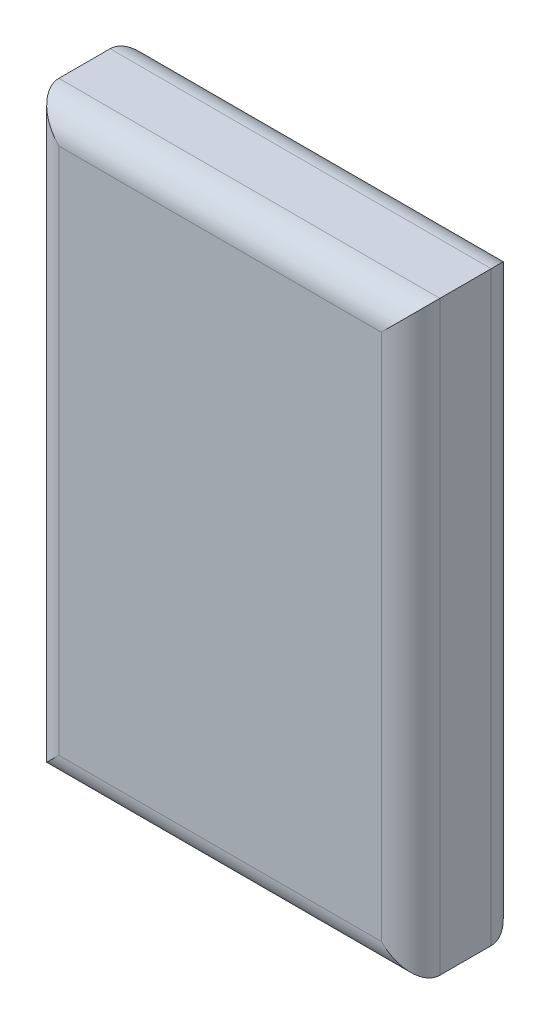
ISO-10303-21;
HEADER;
FILE_DESCRIPTION(('STEP AP214'),'2;1');
FILE_NAME('part.step','',(''),(''),'','','');
FILE_SCHEMA(('AUTOMOTIVE_DESIGN { 1 0 10303 214 1 1 1 1 }'));
ENDSEC;
DATA;
#1=APPLICATION_CONTEXT('core data for automotive mechanical design processes');
#2=APPLICATION_PROTOCOL_DEFINITION('international standard','automotive_design',2000,#1);
#3=PRODUCT_CONTEXT('',#1,'mechanical');
#4=PRODUCT('Part','Part','',(#3));
#5=PRODUCT_RELATED_PRODUCT_CATEGORY('part','',(#4));
#6=PRODUCT_DEFINITION_FORMATION('','',#4);
#7=PRODUCT_DEFINITION_CONTEXT('part definition',#1,'design');
#8=PRODUCT_DEFINITION('design','',#6,#7);
#9=PRODUCT_DEFINITION_SHAPE('','',#8);
#10=(LENGTH_UNIT() NAMED_UNIT(*) SI_UNIT(.MILLI.,.METRE.));
#11=(NAMED_UNIT(*) PLANE_ANGLE_UNIT() SI_UNIT($,.RADIAN.));
#12=(NAMED_UNIT(*) SI_UNIT($,.STERADIAN.) SOLID_ANGLE_UNIT());
#13=UNCERTAINTY_MEASURE_WITH_UNIT(LENGTH_MEASURE(1.E-05),#10,'distance_accuracy_value','');
#14=(GEOMETRIC_REPRESENTATION_CONTEXT(3) GLOBAL_UNCERTAINTY_ASSIGNED_CONTEXT((#13)) GLOBAL_UNIT_ASSIGNED_CONTEXT((#10,
#11,#12)) REPRESENTATION_CONTEXT('',''));
#15=CARTESIAN_POINT('',(0.,0.,0.));
#16=DIRECTION('',(0.,0.,1.));
#17=DIRECTION('',(1.,0.,0.));
#18=AXIS2_PLACEMENT_3D('',#15,#16,#17);
#19=CARTESIAN_POINT('',(-16.51,25.4,9.525));
#20=DIRECTION('',(1.,0.,0.));
#21=DIRECTION('',(0.,1.,0.));
#22=AXIS2_PLACEMENT_3D('',#19,#20,#21);
#23=PLANE('',#22);
#24=DIRECTION('',(0.,0.,-1.));
#25=VECTOR('',#24,1.);
#26=CARTESIAN_POINT('',(-16.51,25.4,9.525));
#27=LINE('',#26,#25);
#28=CARTESIAN_POINT('',(-16.51,25.4,6.985));
#29=VERTEX_POINT('',#28);
#30=CARTESIAN_POINT('',(-16.51,25.4,2.54));
#31=VERTEX_POINT('',#30);
#32=EDGE_CURVE('E143',#29,#31,#27,.T.);
#33=ORIENTED_EDGE('',*,*,#32,.T.);
#34=DIRECTION('',(0.,-1.,0.));
#35=VECTOR('',#34,1.);
#36=CARTESIAN_POINT('',(-16.51,-25.4,2.54));
#37=LINE('',#36,#35);
#38=CARTESIAN_POINT('',(-16.51,-25.4,2.54));
#39=VERTEX_POINT('',#38);
#40=EDGE_CURVE('E152',#31,#39,#37,.T.);
#41=ORIENTED_EDGE('',*,*,#40,.T.);
#42=DIRECTION('',(0.,0.,-1.));
#43=VECTOR('',#42,1.);
#44=CARTESIAN_POINT('',(-16.51,-25.4,9.525));
#45=LINE('',#44,#43);
#46=CARTESIAN_POINT('',(-16.51,-25.4,6.985));
#47=VERTEX_POINT('',#46);
#48=EDGE_CURVE('E121',#47,#39,#45,.T.);
#49=ORIENTED_EDGE('',*,*,#48,.F.);
#50=DIRECTION('',(0.,-1.,0.));
#51=VECTOR('',#50,1.);
#52=CARTESIAN_POINT('',(-16.51,25.4,6.985));
#53=LINE('',#52,#51);
#54=EDGE_CURVE('E154',#47,#29,#53,.F.);
#55=ORIENTED_EDGE('',*,*,#54,.T.);
#56=EDGE_LOOP('',(#33,#41,#49,#55));
#57=FACE_BOUND('',#56,.T.);
#58=ADVANCED_FACE('F34',(#57),#23,.F.);
#59=CARTESIAN_POINT('',(16.51,-25.4,9.525));
#60=DIRECTION('',(0.,1.,0.));
#61=DIRECTION('',(-1.,0.,0.));
#62=AXIS2_PLACEMENT_3D('',#59,#60,#61);
#63=PLANE('',#62);
#64=ORIENTED_EDGE('',*,*,#48,.T.);
#65=DIRECTION('',(1.,0.,0.));
#66=VECTOR('',#65,1.);
#67=CARTESIAN_POINT('',(16.51,-25.4,2.54));
#68=LINE('',#67,#66);
#69=CARTESIAN_POINT('',(16.51,-25.4,2.54));
#70=VERTEX_POINT('',#69);
#71=EDGE_CURVE('E120',#39,#70,#68,.T.);
#72=ORIENTED_EDGE('',*,*,#71,.T.);
#73=DIRECTION('',(0.,0.,-1.));
#74=VECTOR('',#73,1.);
#75=CARTESIAN_POINT('',(16.51,-25.4,9.525));
#76=LINE('',#75,#74);
#77=CARTESIAN_POINT('',(16.51,-25.4,6.985));
#78=VERTEX_POINT('',#77);
#79=EDGE_CURVE('E103',#78,#70,#76,.T.);
#80=ORIENTED_EDGE('',*,*,#79,.F.);
#81=DIRECTION('',(1.,0.,0.));
#82=VECTOR('',#81,1.);
#83=CARTESIAN_POINT('',(16.51,-25.4,6.985));
#84=LINE('',#83,#82);
#85=EDGE_CURVE('E117',#78,#47,#84,.F.);
#86=ORIENTED_EDGE('',*,*,#85,.T.);
#87=EDGE_LOOP('',(#64,#72,#80,#86));
#88=FACE_BOUND('',#87,.T.);
#89=ADVANCED_FACE('F116',(#88),#63,.F.);
#90=CARTESIAN_POINT('',(16.51,25.4,9.525));
#91=DIRECTION('',(-1.,0.,0.));
#92=DIRECTION('',(0.,-1.,0.));
#93=AXIS2_PLACEMENT_3D('',#90,#91,#92);
#94=PLANE('',#93);
#95=ORIENTED_EDGE('',*,*,#79,.T.);
#96=DIRECTION('',(0.,1.,0.));
#97=VECTOR('',#96,1.);
#98=CARTESIAN_POINT('',(16.51,25.4,2.54));
#99=LINE('',#98,#97);
#100=CARTESIAN_POINT('',(16.51,25.4,2.54));
#101=VERTEX_POINT('',#100);
#102=EDGE_CURVE('E109',#70,#101,#99,.T.);
#103=ORIENTED_EDGE('',*,*,#102,.T.);
#104=DIRECTION('',(0.,0.,-1.));
#105=VECTOR('',#104,1.);
#106=CARTESIAN_POINT('',(16.51,25.4,9.525));
#107=LINE('',#106,#105);
#108=CARTESIAN_POINT('',(16.51,25.4,6.985));
#109=VERTEX_POINT('',#108);
#110=EDGE_CURVE('E105',#109,#101,#107,.T.);
#111=ORIENTED_EDGE('',*,*,#110,.F.);
#112=DIRECTION('',(0.,1.,0.));
#113=VECTOR('',#112,1.);
#114=CARTESIAN_POINT('',(16.51,25.4,6.985));
#115=LINE('',#114,#113);
#116=EDGE_CURVE('E100',#109,#78,#115,.F.);
#117=ORIENTED_EDGE('',*,*,#116,.T.);
#118=EDGE_LOOP('',(#95,#103,#111,#117));
#119=FACE_BOUND('',#118,.T.);
#120=ADVANCED_FACE('F102',(#119),#94,.F.);
#121=CARTESIAN_POINT('',(16.51,25.4,9.525));
#122=DIRECTION('',(0.,-1.,0.));
#123=DIRECTION('',(1.,0.,0.));
#124=AXIS2_PLACEMENT_3D('',#121,#122,#123);
#125=PLANE('',#124);
#126=ORIENTED_EDGE('',*,*,#110,.T.);
#127=DIRECTION('',(-1.,0.,0.));
#128=VECTOR('',#127,1.);
#129=CARTESIAN_POINT('',(-16.51,25.4,2.54));
#130=LINE('',#129,#128);
#131=EDGE_CURVE('E156',#101,#31,#130,.T.);
#132=ORIENTED_EDGE('',*,*,#131,.T.);
#133=ORIENTED_EDGE('',*,*,#32,.F.);
#134=DIRECTION('',(-1.,0.,0.));
#135=VECTOR('',#134,1.);
#136=CARTESIAN_POINT('',(16.51,25.4,6.985));
#137=LINE('',#136,#135);
#138=EDGE_CURVE('E158',#29,#109,#137,.F.);
#139=ORIENTED_EDGE('',*,*,#138,.T.);
#140=EDGE_LOOP('',(#126,#132,#133,#139));
#141=FACE_BOUND('',#140,.T.);
#142=ADVANCED_FACE('F196',(#141),#125,.F.);
#143=CARTESIAN_POINT('',(0.,0.,9.525));
#144=DIRECTION('',(0.,0.,-1.));
#145=DIRECTION('',(-1.,0.,0.));
#146=AXIS2_PLACEMENT_3D('',#143,#144,#145);
#147=PLANE('',#146);
#148=DIRECTION('',(0.,1.,0.));
#149=VECTOR('',#148,1.);
#150=CARTESIAN_POINT('',(13.97,0.,9.525));
#151=LINE('',#150,#149);
#152=CARTESIAN_POINT('',(13.97,-22.86,9.525));
#153=VERTEX_POINT('',#152);
#154=CARTESIAN_POINT('',(13.97,22.86,9.525));
#155=VERTEX_POINT('',#154);
#156=EDGE_CURVE('E43',#153,#155,#151,.T.);
#157=ORIENTED_EDGE('',*,*,#156,.T.);
#158=DIRECTION('',(-1.,0.,0.));
#159=VECTOR('',#158,1.);
#160=CARTESIAN_POINT('',(0.,22.86,9.525));
#161=LINE('',#160,#159);
#162=CARTESIAN_POINT('',(-13.97,22.86,9.525));
#163=VERTEX_POINT('',#162);
#164=EDGE_CURVE('E11',#155,#163,#161,.T.);
#165=ORIENTED_EDGE('',*,*,#164,.T.);
#166=DIRECTION('',(0.,-1.,0.));
#167=VECTOR('',#166,1.);
#168=CARTESIAN_POINT('',(-13.97,0.,9.525));
#169=LINE('',#168,#167);
#170=CARTESIAN_POINT('',(-13.97,-22.86,9.525));
#171=VERTEX_POINT('',#170);
#172=EDGE_CURVE('E150',#163,#171,#169,.T.);
#173=ORIENTED_EDGE('',*,*,#172,.T.);
#174=DIRECTION('',(1.,0.,0.));
#175=VECTOR('',#174,1.);
#176=CARTESIAN_POINT('',(0.,-22.86,9.525));
#177=LINE('',#176,#175);
#178=EDGE_CURVE('E54',#171,#153,#177,.T.);
#179=ORIENTED_EDGE('',*,*,#178,.T.);
#180=EDGE_LOOP('',(#157,#165,#173,#179));
#181=FACE_BOUND('',#180,.T.);
#182=ADVANCED_FACE('F202',(#181),#147,.F.);
#183=CARTESIAN_POINT('',(0.,0.,0.));
#184=DIRECTION('',(0.,0.,-1.));
#185=DIRECTION('',(-1.,0.,0.));
#186=AXIS2_PLACEMENT_3D('',#183,#184,#185);
#187=PLANE('',#186);
#188=DIRECTION('',(0.,1.,0.));
#189=VECTOR('',#188,1.);
#190=CARTESIAN_POINT('',(13.97,-25.4,0.));
#191=LINE('',#190,#189);
#192=CARTESIAN_POINT('',(13.97,22.86,0.));
#193=VERTEX_POINT('',#192);
#194=CARTESIAN_POINT('',(13.97,-22.86,0.));
#195=VERTEX_POINT('',#194);
#196=EDGE_CURVE('E163',#193,#195,#191,.F.);
#197=ORIENTED_EDGE('',*,*,#196,.T.);
#198=DIRECTION('',(1.,0.,0.));
#199=VECTOR('',#198,1.);
#200=CARTESIAN_POINT('',(-16.51,-22.86,0.));
#201=LINE('',#200,#199);
#202=CARTESIAN_POINT('',(-13.97,-22.86,0.));
#203=VERTEX_POINT('',#202);
#204=EDGE_CURVE('E110',#195,#203,#201,.F.);
#205=ORIENTED_EDGE('',*,*,#204,.T.);
#206=DIRECTION('',(0.,-1.,0.));
#207=VECTOR('',#206,1.);
#208=CARTESIAN_POINT('',(-13.97,25.4,0.));
#209=LINE('',#208,#207);
#210=CARTESIAN_POINT('',(-13.97,22.86,0.));
#211=VERTEX_POINT('',#210);
#212=EDGE_CURVE('E167',#203,#211,#209,.F.);
#213=ORIENTED_EDGE('',*,*,#212,.T.);
#214=DIRECTION('',(-1.,0.,0.));
#215=VECTOR('',#214,1.);
#216=CARTESIAN_POINT('',(16.51,22.86,0.));
#217=LINE('',#216,#215);
#218=EDGE_CURVE('E165',#211,#193,#217,.F.);
#219=ORIENTED_EDGE('',*,*,#218,.T.);
#220=EDGE_LOOP('',(#197,#205,#213,#219));
#221=FACE_BOUND('',#220,.T.);
#222=ADVANCED_FACE('F204',(#221),#187,.T.);
#223=CARTESIAN_POINT('',(16.51,22.86,2.54));
#224=DIRECTION('',(1.,0.,0.));
#225=DIRECTION('',(0.,1.,0.));
#226=AXIS2_PLACEMENT_3D('',#223,#224,#225);
#227=CYLINDRICAL_SURFACE('',#226,2.54);
#228=CARTESIAN_POINT('',(13.97,22.86,2.54));
#229=DIRECTION('',(0.707106781186548,-0.707106781186547,0.));
#230=DIRECTION('',(0.707106781186547,0.707106781186548,0.));
#231=AXIS2_PLACEMENT_3D('',#228,#229,#230);
#232=ELLIPSE('',#231,3.59210244842766,2.54);
#233=EDGE_CURVE('E144',#193,#101,#232,.T.);
#234=ORIENTED_EDGE('',*,*,#233,.F.);
#235=ORIENTED_EDGE('',*,*,#218,.F.);
#236=CARTESIAN_POINT('',(-13.97,22.86,2.54));
#237=DIRECTION('',(0.707106781186547,0.707106781186548,0.));
#238=DIRECTION('',(-0.707106781186548,0.707106781186547,0.));
#239=AXIS2_PLACEMENT_3D('',#236,#237,#238);
#240=ELLIPSE('',#239,3.59210244842766,2.54);
#241=EDGE_CURVE('E140',#31,#211,#240,.F.);
#242=ORIENTED_EDGE('',*,*,#241,.F.);
#243=ORIENTED_EDGE('',*,*,#131,.F.);
#244=EDGE_LOOP('',(#234,#235,#242,#243));
#245=FACE_BOUND('',#244,.T.);
#246=ADVANCED_FACE('F183',(#245),#227,.T.);
#247=CARTESIAN_POINT('',(-13.97,25.4,2.54));
#248=DIRECTION('',(0.,1.,0.));
#249=DIRECTION('',(-1.,0.,0.));
#250=AXIS2_PLACEMENT_3D('',#247,#248,#249);
#251=CYLINDRICAL_SURFACE('',#250,2.54);
#252=ORIENTED_EDGE('',*,*,#241,.T.);
#253=ORIENTED_EDGE('',*,*,#212,.F.);
#254=CARTESIAN_POINT('',(-13.97,-22.86,2.54));
#255=DIRECTION('',(-0.707106781186548,0.707106781186547,0.));
#256=DIRECTION('',(0.707106781186547,0.707106781186548,0.));
#257=AXIS2_PLACEMENT_3D('',#254,#255,#256);
#258=ELLIPSE('',#257,3.59210244842766,2.54);
#259=EDGE_CURVE('E131',#39,#203,#258,.F.);
#260=ORIENTED_EDGE('',*,*,#259,.F.);
#261=ORIENTED_EDGE('',*,*,#40,.F.);
#262=EDGE_LOOP('',(#252,#253,#260,#261));
#263=FACE_BOUND('',#262,.T.);
#264=ADVANCED_FACE('F187',(#263),#251,.T.);
#265=CARTESIAN_POINT('',(13.97,25.4,2.54));
#266=DIRECTION('',(0.,-1.,0.));
#267=DIRECTION('',(1.,0.,0.));
#268=AXIS2_PLACEMENT_3D('',#265,#266,#267);
#269=CYLINDRICAL_SURFACE('',#268,2.54);
#270=ORIENTED_EDGE('',*,*,#233,.T.);
#271=ORIENTED_EDGE('',*,*,#102,.F.);
#272=CARTESIAN_POINT('',(13.97,-22.86,2.54));
#273=DIRECTION('',(-0.707106781186547,-0.707106781186548,0.));
#274=DIRECTION('',(0.707106781186548,-0.707106781186547,0.));
#275=AXIS2_PLACEMENT_3D('',#272,#273,#274);
#276=ELLIPSE('',#275,3.59210244842766,2.54);
#277=EDGE_CURVE('E130',#195,#70,#276,.T.);
#278=ORIENTED_EDGE('',*,*,#277,.F.);
#279=ORIENTED_EDGE('',*,*,#196,.F.);
#280=EDGE_LOOP('',(#270,#271,#278,#279));
#281=FACE_BOUND('',#280,.T.);
#282=ADVANCED_FACE('F195',(#281),#269,.T.);
#283=CARTESIAN_POINT('',(16.51,-22.86,2.54));
#284=DIRECTION('',(-1.,0.,0.));
#285=DIRECTION('',(0.,-1.,0.));
#286=AXIS2_PLACEMENT_3D('',#283,#284,#285);
#287=CYLINDRICAL_SURFACE('',#286,2.54);
#288=ORIENTED_EDGE('',*,*,#259,.T.);
#289=ORIENTED_EDGE('',*,*,#204,.F.);
#290=ORIENTED_EDGE('',*,*,#277,.T.);
#291=ORIENTED_EDGE('',*,*,#71,.F.);
#292=EDGE_LOOP('',(#288,#289,#290,#291));
#293=FACE_BOUND('',#292,.T.);
#294=ADVANCED_FACE('F190',(#293),#287,.T.);
#295=CARTESIAN_POINT('',(0.,-22.86,6.985));
#296=DIRECTION('',(1.,0.,0.));
#297=DIRECTION('',(0.,1.,0.));
#298=AXIS2_PLACEMENT_3D('',#295,#296,#297);
#299=CYLINDRICAL_SURFACE('',#298,2.54);
#300=CARTESIAN_POINT('',(-13.97,-22.86,6.985));
#301=DIRECTION('',(0.707106781186548,-0.707106781186547,0.));
#302=DIRECTION('',(-0.707106781186547,-0.707106781186548,0.));
#303=AXIS2_PLACEMENT_3D('',#300,#301,#302);
#304=ELLIPSE('',#303,3.59210244842766,2.54);
#305=EDGE_CURVE('E126',#47,#171,#304,.F.);
#306=ORIENTED_EDGE('',*,*,#305,.F.);
#307=ORIENTED_EDGE('',*,*,#85,.F.);
#308=CARTESIAN_POINT('',(13.97,-22.86,6.985));
#309=DIRECTION('',(0.707106781186547,0.707106781186548,0.));
#310=DIRECTION('',(0.707106781186548,-0.707106781186547,0.));
#311=AXIS2_PLACEMENT_3D('',#308,#309,#310);
#312=ELLIPSE('',#311,3.59210244842766,2.54);
#313=EDGE_CURVE('E38',#153,#78,#312,.T.);
#314=ORIENTED_EDGE('',*,*,#313,.F.);
#315=ORIENTED_EDGE('',*,*,#178,.F.);
#316=EDGE_LOOP('',(#306,#307,#314,#315));
#317=FACE_BOUND('',#316,.T.);
#318=ADVANCED_FACE('F36',(#317),#299,.T.);
#319=CARTESIAN_POINT('',(13.97,0.,6.985));
#320=DIRECTION('',(0.,1.,0.));
#321=DIRECTION('',(-1.,0.,0.));
#322=AXIS2_PLACEMENT_3D('',#319,#320,#321);
#323=CYLINDRICAL_SURFACE('',#322,2.54);
#324=ORIENTED_EDGE('',*,*,#313,.T.);
#325=ORIENTED_EDGE('',*,*,#116,.F.);
#326=CARTESIAN_POINT('',(13.97,22.86,6.985));
#327=DIRECTION('',(-0.707106781186548,0.707106781186547,0.));
#328=DIRECTION('',(0.707106781186547,0.707106781186548,0.));
#329=AXIS2_PLACEMENT_3D('',#326,#327,#328);
#330=ELLIPSE('',#329,3.59210244842766,2.54);
#331=EDGE_CURVE('E133',#155,#109,#330,.T.);
#332=ORIENTED_EDGE('',*,*,#331,.F.);
#333=ORIENTED_EDGE('',*,*,#156,.F.);
#334=EDGE_LOOP('',(#324,#325,#332,#333));
#335=FACE_BOUND('',#334,.T.);
#336=ADVANCED_FACE('F129',(#335),#323,.T.);
#337=CARTESIAN_POINT('',(-13.97,0.,6.985));
#338=DIRECTION('',(0.,-1.,0.));
#339=DIRECTION('',(1.,0.,0.));
#340=AXIS2_PLACEMENT_3D('',#337,#338,#339);
#341=CYLINDRICAL_SURFACE('',#340,2.54);
#342=ORIENTED_EDGE('',*,*,#305,.T.);
#343=ORIENTED_EDGE('',*,*,#172,.F.);
#344=CARTESIAN_POINT('',(-13.97,22.86,6.985));
#345=DIRECTION('',(-0.707106781186547,-0.707106781186548,0.));
#346=DIRECTION('',(0.707106781186548,-0.707106781186547,0.));
#347=AXIS2_PLACEMENT_3D('',#344,#345,#346);
#348=ELLIPSE('',#347,3.59210244842766,2.54);
#349=EDGE_CURVE('E136',#29,#163,#348,.F.);
#350=ORIENTED_EDGE('',*,*,#349,.F.);
#351=ORIENTED_EDGE('',*,*,#54,.F.);
#352=EDGE_LOOP('',(#342,#343,#350,#351));
#353=FACE_BOUND('',#352,.T.);
#354=ADVANCED_FACE('F201',(#353),#341,.T.);
#355=CARTESIAN_POINT('',(0.,22.86,6.985));
#356=DIRECTION('',(-1.,0.,0.));
#357=DIRECTION('',(0.,-1.,0.));
#358=AXIS2_PLACEMENT_3D('',#355,#356,#357);
#359=CYLINDRICAL_SURFACE('',#358,2.54);
#360=ORIENTED_EDGE('',*,*,#331,.T.);
#361=ORIENTED_EDGE('',*,*,#138,.F.);
#362=ORIENTED_EDGE('',*,*,#349,.T.);
#363=ORIENTED_EDGE('',*,*,#164,.F.);
#364=EDGE_LOOP('',(#360,#361,#362,#363));
#365=FACE_BOUND('',#364,.T.);
#366=ADVANCED_FACE('F199',(#365),#359,.T.);
#367=CLOSED_SHELL('',(#58,#89,#120,#142,#182,#222,#246,#264,#282,#294,#318,#336,#354,#366));
#368=MANIFOLD_SOLID_BREP('B2',#367);
#369=ADVANCED_BREP_SHAPE_REPRESENTATION('',(#18,#368),#14);
#370=SHAPE_DEFINITION_REPRESENTATION(#9,#369);
ENDSEC;
END-ISO-10303-21;
